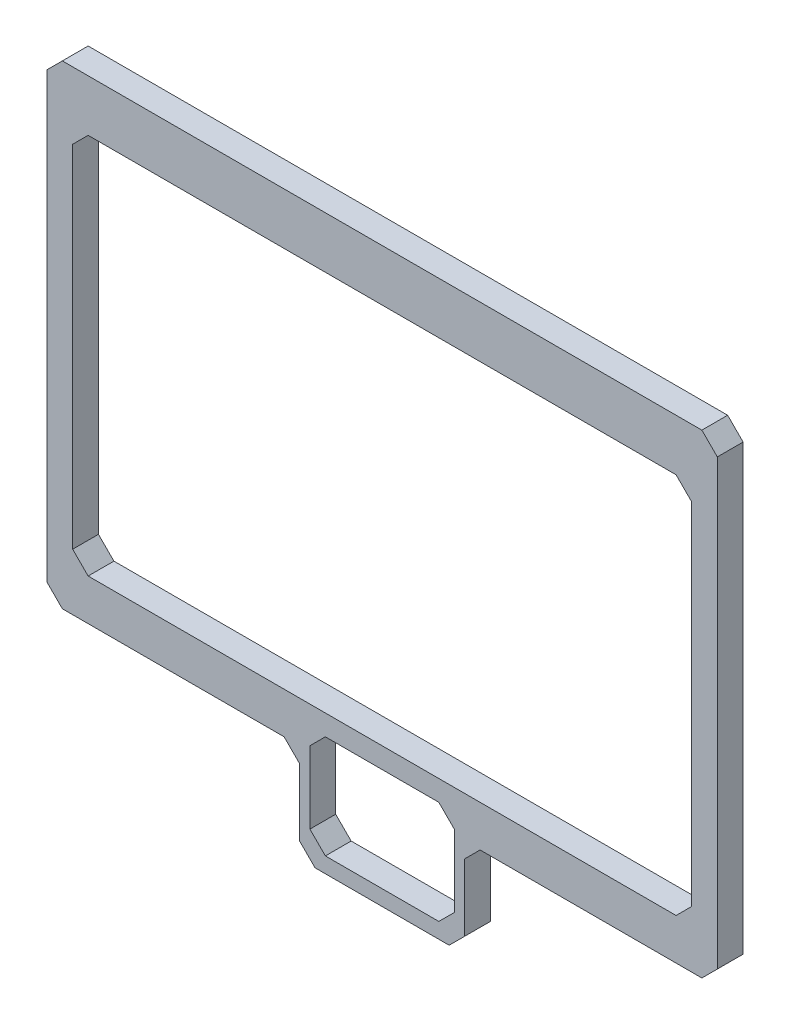
ISO-10303-21;
HEADER;
FILE_DESCRIPTION(('STEP AP214'),'2;1');
FILE_NAME('part.step','',(''),(''),'','','');
FILE_SCHEMA(('AUTOMOTIVE_DESIGN { 1 0 10303 214 1 1 1 1 }'));
ENDSEC;
DATA;
#1=APPLICATION_CONTEXT('core data for automotive mechanical design processes');
#2=APPLICATION_PROTOCOL_DEFINITION('international standard','automotive_design',2000,#1);
#3=PRODUCT_CONTEXT('',#1,'mechanical');
#4=PRODUCT('Part','Part','',(#3));
#5=PRODUCT_RELATED_PRODUCT_CATEGORY('part','',(#4));
#6=PRODUCT_DEFINITION_FORMATION('','',#4);
#7=PRODUCT_DEFINITION_CONTEXT('part definition',#1,'design');
#8=PRODUCT_DEFINITION('design','',#6,#7);
#9=PRODUCT_DEFINITION_SHAPE('','',#8);
#10=(LENGTH_UNIT() NAMED_UNIT(*) SI_UNIT(.MILLI.,.METRE.));
#11=(NAMED_UNIT(*) PLANE_ANGLE_UNIT() SI_UNIT($,.RADIAN.));
#12=(NAMED_UNIT(*) SI_UNIT($,.STERADIAN.) SOLID_ANGLE_UNIT());
#13=UNCERTAINTY_MEASURE_WITH_UNIT(LENGTH_MEASURE(1.E-05),#10,'distance_accuracy_value','');
#14=(GEOMETRIC_REPRESENTATION_CONTEXT(3) GLOBAL_UNCERTAINTY_ASSIGNED_CONTEXT((#13)) GLOBAL_UNIT_ASSIGNED_CONTEXT((#10,
#11,#12)) REPRESENTATION_CONTEXT('',''));
#15=CARTESIAN_POINT('',(0.,0.,0.));
#16=DIRECTION('',(0.,0.,1.));
#17=DIRECTION('',(1.,0.,0.));
#18=AXIS2_PLACEMENT_3D('',#15,#16,#17);
#19=CARTESIAN_POINT('',(0.,0.,5.));
#20=DIRECTION('',(0.,0.,1.));
#21=DIRECTION('',(1.,0.,0.));
#22=AXIS2_PLACEMENT_3D('',#19,#20,#21);
#23=PLANE('',#22);
#24=DIRECTION('',(0.707106781186547,0.707106781186547,0.));
#25=VECTOR('',#24,1.);
#26=CARTESIAN_POINT('',(78.,-101.,5.));
#27=LINE('',#26,#25);
#28=CARTESIAN_POINT('',(78.,-101.,5.));
#29=VERTEX_POINT('',#28);
#30=CARTESIAN_POINT('',(81.,-98.,5.));
#31=VERTEX_POINT('',#30);
#32=EDGE_CURVE('E366',#29,#31,#27,.T.);
#33=ORIENTED_EDGE('',*,*,#32,.T.);
#34=DIRECTION('',(0.,1.,0.));
#35=VECTOR('',#34,1.);
#36=CARTESIAN_POINT('',(81.,-98.,5.));
#37=LINE('',#36,#35);
#38=CARTESIAN_POINT('',(81.,-85.,5.));
#39=VERTEX_POINT('',#38);
#40=EDGE_CURVE('E369',#31,#39,#37,.T.);
#41=ORIENTED_EDGE('',*,*,#40,.T.);
#42=DIRECTION('',(0.707106781186551,0.707106781186544,0.));
#43=VECTOR('',#42,1.);
#44=CARTESIAN_POINT('',(81.,-85.,5.));
#45=LINE('',#44,#43);
#46=CARTESIAN_POINT('',(84.,-82.,5.));
#47=VERTEX_POINT('',#46);
#48=EDGE_CURVE('E372',#39,#47,#45,.T.);
#49=ORIENTED_EDGE('',*,*,#48,.T.);
#50=DIRECTION('',(1.,0.,0.));
#51=VECTOR('',#50,1.);
#52=CARTESIAN_POINT('',(127.,-82.,5.));
#53=LINE('',#52,#51);
#54=CARTESIAN_POINT('',(127.,-82.,5.));
#55=VERTEX_POINT('',#54);
#56=EDGE_CURVE('E374',#47,#55,#53,.T.);
#57=ORIENTED_EDGE('',*,*,#56,.T.);
#58=DIRECTION('',(0.707106781186548,0.707106781186548,0.));
#59=VECTOR('',#58,1.);
#60=CARTESIAN_POINT('',(127.,-82.,5.));
#61=LINE('',#60,#59);
#62=CARTESIAN_POINT('',(130.,-79.,5.));
#63=VERTEX_POINT('',#62);
#64=EDGE_CURVE('E376',#55,#63,#61,.T.);
#65=ORIENTED_EDGE('',*,*,#64,.T.);
#66=DIRECTION('',(0.,1.,0.));
#67=VECTOR('',#66,1.);
#68=CARTESIAN_POINT('',(130.,7.00000000000002,5.));
#69=LINE('',#68,#67);
#70=CARTESIAN_POINT('',(130.,7.00000000000002,5.));
#71=VERTEX_POINT('',#70);
#72=EDGE_CURVE('E378',#63,#71,#69,.T.);
#73=ORIENTED_EDGE('',*,*,#72,.T.);
#74=DIRECTION('',(-0.707106781186548,0.707106781186548,0.));
#75=VECTOR('',#74,1.);
#76=CARTESIAN_POINT('',(130.,7.00000000000002,5.));
#77=LINE('',#76,#75);
#78=CARTESIAN_POINT('',(127.,10.,5.));
#79=VERTEX_POINT('',#78);
#80=EDGE_CURVE('E380',#71,#79,#77,.T.);
#81=ORIENTED_EDGE('',*,*,#80,.T.);
#82=DIRECTION('',(-1.,0.,0.));
#83=VECTOR('',#82,1.);
#84=CARTESIAN_POINT('',(3.,10.,5.));
#85=LINE('',#84,#83);
#86=CARTESIAN_POINT('',(3.,10.,5.));
#87=VERTEX_POINT('',#86);
#88=EDGE_CURVE('E382',#79,#87,#85,.T.);
#89=ORIENTED_EDGE('',*,*,#88,.T.);
#90=DIRECTION('',(-0.707106781186544,-0.707106781186551,0.));
#91=VECTOR('',#90,1.);
#92=CARTESIAN_POINT('',(3.,10.,5.));
#93=LINE('',#92,#91);
#94=CARTESIAN_POINT('',(0.,6.99999999999997,5.));
#95=VERTEX_POINT('',#94);
#96=EDGE_CURVE('E384',#87,#95,#93,.T.);
#97=ORIENTED_EDGE('',*,*,#96,.T.);
#98=DIRECTION('',(0.,-1.,0.));
#99=VECTOR('',#98,1.);
#100=CARTESIAN_POINT('',(0.,6.99999999999997,5.));
#101=LINE('',#100,#99);
#102=CARTESIAN_POINT('',(0.,-79.,5.));
#103=VERTEX_POINT('',#102);
#104=EDGE_CURVE('E386',#95,#103,#101,.T.);
#105=ORIENTED_EDGE('',*,*,#104,.T.);
#106=DIRECTION('',(0.707106781186544,-0.707106781186551,0.));
#107=VECTOR('',#106,1.);
#108=CARTESIAN_POINT('',(0.,-79.,5.));
#109=LINE('',#108,#107);
#110=CARTESIAN_POINT('',(3.,-82.,5.));
#111=VERTEX_POINT('',#110);
#112=EDGE_CURVE('E388',#103,#111,#109,.T.);
#113=ORIENTED_EDGE('',*,*,#112,.T.);
#114=DIRECTION('',(1.,0.,0.));
#115=VECTOR('',#114,1.);
#116=CARTESIAN_POINT('',(46.,-82.,5.));
#117=LINE('',#116,#115);
#118=CARTESIAN_POINT('',(46.,-82.,5.));
#119=VERTEX_POINT('',#118);
#120=EDGE_CURVE('E390',#111,#119,#117,.T.);
#121=ORIENTED_EDGE('',*,*,#120,.T.);
#122=DIRECTION('',(0.707106781186541,-0.707106781186554,0.));
#123=VECTOR('',#122,1.);
#124=CARTESIAN_POINT('',(46.,-82.,5.));
#125=LINE('',#124,#123);
#126=CARTESIAN_POINT('',(49.,-85.,5.));
#127=VERTEX_POINT('',#126);
#128=EDGE_CURVE('E392',#119,#127,#125,.T.);
#129=ORIENTED_EDGE('',*,*,#128,.T.);
#130=DIRECTION('',(0.,-1.,0.));
#131=VECTOR('',#130,1.);
#132=CARTESIAN_POINT('',(49.,-85.,5.));
#133=LINE('',#132,#131);
#134=CARTESIAN_POINT('',(49.,-98.,5.));
#135=VERTEX_POINT('',#134);
#136=EDGE_CURVE('E394',#127,#135,#133,.T.);
#137=ORIENTED_EDGE('',*,*,#136,.T.);
#138=DIRECTION('',(0.707106781186547,-0.707106781186547,0.));
#139=VECTOR('',#138,1.);
#140=CARTESIAN_POINT('',(49.,-98.,5.));
#141=LINE('',#140,#139);
#142=CARTESIAN_POINT('',(52.,-101.,5.));
#143=VERTEX_POINT('',#142);
#144=EDGE_CURVE('E396',#135,#143,#141,.T.);
#145=ORIENTED_EDGE('',*,*,#144,.T.);
#146=DIRECTION('',(1.,0.,0.));
#147=VECTOR('',#146,1.);
#148=CARTESIAN_POINT('',(52.,-101.,5.));
#149=LINE('',#148,#147);
#150=EDGE_CURVE('E398',#143,#29,#149,.T.);
#151=ORIENTED_EDGE('',*,*,#150,.T.);
#152=EDGE_LOOP('',(#33,#41,#49,#57,#65,#73,#81,#89,#97,#105,#113,#121,#129,#137,#145,#151));
#153=FACE_BOUND('',#152,.T.);
#154=DIRECTION('',(-1.,0.,0.));
#155=VECTOR('',#154,1.);
#156=CARTESIAN_POINT('',(54.,-78.,5.));
#157=LINE('',#156,#155);
#158=CARTESIAN_POINT('',(76.,-78.,5.));
#159=VERTEX_POINT('',#158);
#160=CARTESIAN_POINT('',(54.,-78.,5.));
#161=VERTEX_POINT('',#160);
#162=EDGE_CURVE('E309',#159,#161,#157,.T.);
#163=ORIENTED_EDGE('',*,*,#162,.F.);
#164=DIRECTION('',(-0.707106781186544,0.707106781186551,0.));
#165=VECTOR('',#164,1.);
#166=CARTESIAN_POINT('',(76.,-78.,5.));
#167=LINE('',#166,#165);
#168=CARTESIAN_POINT('',(79.,-81.,5.));
#169=VERTEX_POINT('',#168);
#170=EDGE_CURVE('E307',#169,#159,#167,.T.);
#171=ORIENTED_EDGE('',*,*,#170,.F.);
#172=DIRECTION('',(0.,1.,0.));
#173=VECTOR('',#172,1.);
#174=CARTESIAN_POINT('',(79.,-81.,5.));
#175=LINE('',#174,#173);
#176=CARTESIAN_POINT('',(79.,-95.,5.));
#177=VERTEX_POINT('',#176);
#178=EDGE_CURVE('E323',#177,#169,#175,.T.);
#179=ORIENTED_EDGE('',*,*,#178,.F.);
#180=DIRECTION('',(0.707106781186551,0.707106781186544,0.));
#181=VECTOR('',#180,1.);
#182=CARTESIAN_POINT('',(79.,-95.,5.));
#183=LINE('',#182,#181);
#184=CARTESIAN_POINT('',(76.,-98.,5.));
#185=VERTEX_POINT('',#184);
#186=EDGE_CURVE('E320',#185,#177,#183,.T.);
#187=ORIENTED_EDGE('',*,*,#186,.F.);
#188=DIRECTION('',(1.,0.,0.));
#189=VECTOR('',#188,1.);
#190=CARTESIAN_POINT('',(76.,-98.,5.));
#191=LINE('',#190,#189);
#192=CARTESIAN_POINT('',(54.,-98.,5.));
#193=VERTEX_POINT('',#192);
#194=EDGE_CURVE('E318',#193,#185,#191,.T.);
#195=ORIENTED_EDGE('',*,*,#194,.F.);
#196=DIRECTION('',(0.707106781186544,-0.707106781186551,0.));
#197=VECTOR('',#196,1.);
#198=CARTESIAN_POINT('',(54.,-98.,5.));
#199=LINE('',#198,#197);
#200=CARTESIAN_POINT('',(51.,-95.,5.));
#201=VERTEX_POINT('',#200);
#202=EDGE_CURVE('E316',#201,#193,#199,.T.);
#203=ORIENTED_EDGE('',*,*,#202,.F.);
#204=DIRECTION('',(0.,-1.,0.));
#205=VECTOR('',#204,1.);
#206=CARTESIAN_POINT('',(51.,-95.,5.));
#207=LINE('',#206,#205);
#208=CARTESIAN_POINT('',(51.,-81.,5.));
#209=VERTEX_POINT('',#208);
#210=EDGE_CURVE('E314',#209,#201,#207,.T.);
#211=ORIENTED_EDGE('',*,*,#210,.F.);
#212=DIRECTION('',(-0.707106781186551,-0.707106781186544,0.));
#213=VECTOR('',#212,1.);
#214=CARTESIAN_POINT('',(51.,-81.,5.));
#215=LINE('',#214,#213);
#216=EDGE_CURVE('E312',#161,#209,#215,.T.);
#217=ORIENTED_EDGE('',*,*,#216,.F.);
#218=EDGE_LOOP('',(#163,#171,#179,#187,#195,#203,#211,#217));
#219=FACE_BOUND('',#218,.T.);
#220=DIRECTION('',(1.,0.,0.));
#221=VECTOR('',#220,1.);
#222=CARTESIAN_POINT('',(7.99999999999999,-74.,5.));
#223=LINE('',#222,#221);
#224=CARTESIAN_POINT('',(7.99999999999999,-74.,5.));
#225=VERTEX_POINT('',#224);
#226=CARTESIAN_POINT('',(122.,-74.,5.));
#227=VERTEX_POINT('',#226);
#228=EDGE_CURVE('E250',#225,#227,#223,.T.);
#229=ORIENTED_EDGE('',*,*,#228,.F.);
#230=DIRECTION('',(0.707106781186544,-0.707106781186551,0.));
#231=VECTOR('',#230,1.);
#232=CARTESIAN_POINT('',(7.99999999999999,-74.,5.));
#233=LINE('',#232,#231);
#234=CARTESIAN_POINT('',(4.99999999999999,-71.,5.));
#235=VERTEX_POINT('',#234);
#236=EDGE_CURVE('E242',#235,#225,#233,.T.);
#237=ORIENTED_EDGE('',*,*,#236,.F.);
#238=DIRECTION('',(0.,-1.,0.));
#239=VECTOR('',#238,1.);
#240=CARTESIAN_POINT('',(4.99999999999999,-71.,5.));
#241=LINE('',#240,#239);
#242=CARTESIAN_POINT('',(4.99999999999999,-3.00000000000003,5.));
#243=VERTEX_POINT('',#242);
#244=EDGE_CURVE('E275',#243,#235,#241,.T.);
#245=ORIENTED_EDGE('',*,*,#244,.F.);
#246=DIRECTION('',(-0.707106781186544,-0.707106781186551,0.));
#247=VECTOR('',#246,1.);
#248=CARTESIAN_POINT('',(4.99999999999999,-3.00000000000003,5.));
#249=LINE('',#248,#247);
#250=CARTESIAN_POINT('',(7.99999999999999,0.,5.));
#251=VERTEX_POINT('',#250);
#252=EDGE_CURVE('E273',#251,#243,#249,.T.);
#253=ORIENTED_EDGE('',*,*,#252,.F.);
#254=DIRECTION('',(-1.,0.,0.));
#255=VECTOR('',#254,1.);
#256=CARTESIAN_POINT('',(7.99999999999999,0.,5.));
#257=LINE('',#256,#255);
#258=CARTESIAN_POINT('',(122.,0.,5.));
#259=VERTEX_POINT('',#258);
#260=EDGE_CURVE('E271',#259,#251,#257,.T.);
#261=ORIENTED_EDGE('',*,*,#260,.F.);
#262=DIRECTION('',(-0.707106781186546,0.707106781186549,0.));
#263=VECTOR('',#262,1.);
#264=CARTESIAN_POINT('',(122.,0.,5.));
#265=LINE('',#264,#263);
#266=CARTESIAN_POINT('',(125.,-3.00000000000003,5.));
#267=VERTEX_POINT('',#266);
#268=EDGE_CURVE('E269',#267,#259,#265,.T.);
#269=ORIENTED_EDGE('',*,*,#268,.F.);
#270=DIRECTION('',(0.,1.,0.));
#271=VECTOR('',#270,1.);
#272=CARTESIAN_POINT('',(125.,-71.,5.));
#273=LINE('',#272,#271);
#274=CARTESIAN_POINT('',(125.,-71.,5.));
#275=VERTEX_POINT('',#274);
#276=EDGE_CURVE('E265',#275,#267,#273,.T.);
#277=ORIENTED_EDGE('',*,*,#276,.F.);
#278=DIRECTION('',(0.707106781186552,0.707106781186543,0.));
#279=VECTOR('',#278,1.);
#280=CARTESIAN_POINT('',(125.,-71.,5.));
#281=LINE('',#280,#279);
#282=EDGE_CURVE('E263',#227,#275,#281,.T.);
#283=ORIENTED_EDGE('',*,*,#282,.F.);
#284=EDGE_LOOP('',(#229,#237,#245,#253,#261,#269,#277,#283));
#285=FACE_BOUND('',#284,.T.);
#286=ADVANCED_FACE('F33',(#153,#219,#285),#23,.T.);
#287=CARTESIAN_POINT('',(0.,0.,0.));
#288=DIRECTION('',(0.,0.,1.));
#289=DIRECTION('',(1.,0.,0.));
#290=AXIS2_PLACEMENT_3D('',#287,#288,#289);
#291=PLANE('',#290);
#292=DIRECTION('',(-0.707106781186544,0.707106781186551,0.));
#293=VECTOR('',#292,1.);
#294=CARTESIAN_POINT('',(76.,-78.,0.));
#295=LINE('',#294,#293);
#296=CARTESIAN_POINT('',(79.,-81.,0.));
#297=VERTEX_POINT('',#296);
#298=CARTESIAN_POINT('',(76.,-78.,0.));
#299=VERTEX_POINT('',#298);
#300=EDGE_CURVE('E258',#297,#299,#295,.T.);
#301=ORIENTED_EDGE('',*,*,#300,.T.);
#302=DIRECTION('',(-1.,0.,0.));
#303=VECTOR('',#302,1.);
#304=CARTESIAN_POINT('',(54.,-78.,0.));
#305=LINE('',#304,#303);
#306=CARTESIAN_POINT('',(54.,-78.,0.));
#307=VERTEX_POINT('',#306);
#308=EDGE_CURVE('E328',#299,#307,#305,.T.);
#309=ORIENTED_EDGE('',*,*,#308,.T.);
#310=DIRECTION('',(-0.707106781186551,-0.707106781186544,0.));
#311=VECTOR('',#310,1.);
#312=CARTESIAN_POINT('',(51.,-81.,0.));
#313=LINE('',#312,#311);
#314=CARTESIAN_POINT('',(51.,-81.,0.));
#315=VERTEX_POINT('',#314);
#316=EDGE_CURVE('E331',#307,#315,#313,.T.);
#317=ORIENTED_EDGE('',*,*,#316,.T.);
#318=DIRECTION('',(0.,-1.,0.));
#319=VECTOR('',#318,1.);
#320=CARTESIAN_POINT('',(51.,-95.,0.));
#321=LINE('',#320,#319);
#322=CARTESIAN_POINT('',(51.,-95.,0.));
#323=VERTEX_POINT('',#322);
#324=EDGE_CURVE('E334',#315,#323,#321,.T.);
#325=ORIENTED_EDGE('',*,*,#324,.T.);
#326=DIRECTION('',(0.707106781186544,-0.707106781186551,0.));
#327=VECTOR('',#326,1.);
#328=CARTESIAN_POINT('',(54.,-98.,0.));
#329=LINE('',#328,#327);
#330=CARTESIAN_POINT('',(54.,-98.,0.));
#331=VERTEX_POINT('',#330);
#332=EDGE_CURVE('E337',#323,#331,#329,.T.);
#333=ORIENTED_EDGE('',*,*,#332,.T.);
#334=DIRECTION('',(1.,0.,0.));
#335=VECTOR('',#334,1.);
#336=CARTESIAN_POINT('',(76.,-98.,0.));
#337=LINE('',#336,#335);
#338=CARTESIAN_POINT('',(76.,-98.,0.));
#339=VERTEX_POINT('',#338);
#340=EDGE_CURVE('E340',#331,#339,#337,.T.);
#341=ORIENTED_EDGE('',*,*,#340,.T.);
#342=DIRECTION('',(0.707106781186551,0.707106781186544,0.));
#343=VECTOR('',#342,1.);
#344=CARTESIAN_POINT('',(79.,-95.,0.));
#345=LINE('',#344,#343);
#346=CARTESIAN_POINT('',(79.,-95.,0.));
#347=VERTEX_POINT('',#346);
#348=EDGE_CURVE('E343',#339,#347,#345,.T.);
#349=ORIENTED_EDGE('',*,*,#348,.T.);
#350=DIRECTION('',(0.,1.,0.));
#351=VECTOR('',#350,1.);
#352=CARTESIAN_POINT('',(79.,-81.,0.));
#353=LINE('',#352,#351);
#354=EDGE_CURVE('E310',#347,#297,#353,.T.);
#355=ORIENTED_EDGE('',*,*,#354,.T.);
#356=EDGE_LOOP('',(#301,#309,#317,#325,#333,#341,#349,#355));
#357=FACE_BOUND('',#356,.T.);
#358=DIRECTION('',(0.707106781186547,0.707106781186547,0.));
#359=VECTOR('',#358,1.);
#360=CARTESIAN_POINT('',(78.,-101.,0.));
#361=LINE('',#360,#359);
#362=CARTESIAN_POINT('',(78.,-101.,0.));
#363=VERTEX_POINT('',#362);
#364=CARTESIAN_POINT('',(81.,-98.,0.));
#365=VERTEX_POINT('',#364);
#366=EDGE_CURVE('E365',#363,#365,#361,.T.);
#367=ORIENTED_EDGE('',*,*,#366,.F.);
#368=DIRECTION('',(1.,0.,0.));
#369=VECTOR('',#368,1.);
#370=CARTESIAN_POINT('',(52.,-101.,0.));
#371=LINE('',#370,#369);
#372=CARTESIAN_POINT('',(52.,-101.,0.));
#373=VERTEX_POINT('',#372);
#374=EDGE_CURVE('E370',#373,#363,#371,.T.);
#375=ORIENTED_EDGE('',*,*,#374,.F.);
#376=DIRECTION('',(0.707106781186547,-0.707106781186547,0.));
#377=VECTOR('',#376,1.);
#378=CARTESIAN_POINT('',(49.,-98.,0.));
#379=LINE('',#378,#377);
#380=CARTESIAN_POINT('',(49.,-98.,0.));
#381=VERTEX_POINT('',#380);
#382=EDGE_CURVE('E429',#381,#373,#379,.T.);
#383=ORIENTED_EDGE('',*,*,#382,.F.);
#384=DIRECTION('',(0.,-1.,0.));
#385=VECTOR('',#384,1.);
#386=CARTESIAN_POINT('',(49.,-85.,0.));
#387=LINE('',#386,#385);
#388=CARTESIAN_POINT('',(49.,-85.,0.));
#389=VERTEX_POINT('',#388);
#390=EDGE_CURVE('E427',#389,#381,#387,.T.);
#391=ORIENTED_EDGE('',*,*,#390,.F.);
#392=DIRECTION('',(0.707106781186541,-0.707106781186554,0.));
#393=VECTOR('',#392,1.);
#394=CARTESIAN_POINT('',(46.,-82.,0.));
#395=LINE('',#394,#393);
#396=CARTESIAN_POINT('',(46.,-82.,0.));
#397=VERTEX_POINT('',#396);
#398=EDGE_CURVE('E425',#397,#389,#395,.T.);
#399=ORIENTED_EDGE('',*,*,#398,.F.);
#400=DIRECTION('',(1.,0.,0.));
#401=VECTOR('',#400,1.);
#402=CARTESIAN_POINT('',(46.,-82.,0.));
#403=LINE('',#402,#401);
#404=CARTESIAN_POINT('',(3.,-82.,0.));
#405=VERTEX_POINT('',#404);
#406=EDGE_CURVE('E423',#405,#397,#403,.T.);
#407=ORIENTED_EDGE('',*,*,#406,.F.);
#408=DIRECTION('',(0.707106781186544,-0.707106781186551,0.));
#409=VECTOR('',#408,1.);
#410=CARTESIAN_POINT('',(0.,-79.,0.));
#411=LINE('',#410,#409);
#412=CARTESIAN_POINT('',(0.,-79.,0.));
#413=VERTEX_POINT('',#412);
#414=EDGE_CURVE('E421',#413,#405,#411,.T.);
#415=ORIENTED_EDGE('',*,*,#414,.F.);
#416=DIRECTION('',(0.,-1.,0.));
#417=VECTOR('',#416,1.);
#418=CARTESIAN_POINT('',(0.,6.99999999999997,0.));
#419=LINE('',#418,#417);
#420=CARTESIAN_POINT('',(0.,6.99999999999997,0.));
#421=VERTEX_POINT('',#420);
#422=EDGE_CURVE('E419',#421,#413,#419,.T.);
#423=ORIENTED_EDGE('',*,*,#422,.F.);
#424=DIRECTION('',(-0.707106781186544,-0.707106781186551,0.));
#425=VECTOR('',#424,1.);
#426=CARTESIAN_POINT('',(3.,10.,0.));
#427=LINE('',#426,#425);
#428=CARTESIAN_POINT('',(3.,10.,0.));
#429=VERTEX_POINT('',#428);
#430=EDGE_CURVE('E417',#429,#421,#427,.T.);
#431=ORIENTED_EDGE('',*,*,#430,.F.);
#432=DIRECTION('',(-1.,0.,0.));
#433=VECTOR('',#432,1.);
#434=CARTESIAN_POINT('',(3.,10.,0.));
#435=LINE('',#434,#433);
#436=CARTESIAN_POINT('',(127.,10.,0.));
#437=VERTEX_POINT('',#436);
#438=EDGE_CURVE('E415',#437,#429,#435,.T.);
#439=ORIENTED_EDGE('',*,*,#438,.F.);
#440=DIRECTION('',(-0.707106781186548,0.707106781186548,0.));
#441=VECTOR('',#440,1.);
#442=CARTESIAN_POINT('',(130.,7.00000000000002,0.));
#443=LINE('',#442,#441);
#444=CARTESIAN_POINT('',(130.,7.00000000000002,0.));
#445=VERTEX_POINT('',#444);
#446=EDGE_CURVE('E413',#445,#437,#443,.T.);
#447=ORIENTED_EDGE('',*,*,#446,.F.);
#448=DIRECTION('',(0.,1.,0.));
#449=VECTOR('',#448,1.);
#450=CARTESIAN_POINT('',(130.,7.00000000000002,0.));
#451=LINE('',#450,#449);
#452=CARTESIAN_POINT('',(130.,-79.,0.));
#453=VERTEX_POINT('',#452);
#454=EDGE_CURVE('E411',#453,#445,#451,.T.);
#455=ORIENTED_EDGE('',*,*,#454,.F.);
#456=DIRECTION('',(0.707106781186548,0.707106781186548,0.));
#457=VECTOR('',#456,1.);
#458=CARTESIAN_POINT('',(127.,-82.,0.));
#459=LINE('',#458,#457);
#460=CARTESIAN_POINT('',(127.,-82.,0.));
#461=VERTEX_POINT('',#460);
#462=EDGE_CURVE('E409',#461,#453,#459,.T.);
#463=ORIENTED_EDGE('',*,*,#462,.F.);
#464=DIRECTION('',(1.,0.,0.));
#465=VECTOR('',#464,1.);
#466=CARTESIAN_POINT('',(127.,-82.,0.));
#467=LINE('',#466,#465);
#468=CARTESIAN_POINT('',(84.,-82.,0.));
#469=VERTEX_POINT('',#468);
#470=EDGE_CURVE('E407',#469,#461,#467,.T.);
#471=ORIENTED_EDGE('',*,*,#470,.F.);
#472=DIRECTION('',(0.707106781186551,0.707106781186544,0.));
#473=VECTOR('',#472,1.);
#474=CARTESIAN_POINT('',(81.,-85.,0.));
#475=LINE('',#474,#473);
#476=CARTESIAN_POINT('',(81.,-85.,0.));
#477=VERTEX_POINT('',#476);
#478=EDGE_CURVE('E405',#477,#469,#475,.T.);
#479=ORIENTED_EDGE('',*,*,#478,.F.);
#480=DIRECTION('',(0.,1.,0.));
#481=VECTOR('',#480,1.);
#482=CARTESIAN_POINT('',(81.,-98.,0.));
#483=LINE('',#482,#481);
#484=EDGE_CURVE('E403',#365,#477,#483,.T.);
#485=ORIENTED_EDGE('',*,*,#484,.F.);
#486=EDGE_LOOP('',(#367,#375,#383,#391,#399,#407,#415,#423,#431,#439,#447,#455,#463,#471,#479,#485));
#487=FACE_BOUND('',#486,.T.);
#488=DIRECTION('',(0.707106781186544,-0.707106781186551,0.));
#489=VECTOR('',#488,1.);
#490=CARTESIAN_POINT('',(7.99999999999999,-74.,0.));
#491=LINE('',#490,#489);
#492=CARTESIAN_POINT('',(4.99999999999999,-71.,0.));
#493=VERTEX_POINT('',#492);
#494=CARTESIAN_POINT('',(7.99999999999999,-74.,0.));
#495=VERTEX_POINT('',#494);
#496=EDGE_CURVE('E56',#493,#495,#491,.T.);
#497=ORIENTED_EDGE('',*,*,#496,.T.);
#498=DIRECTION('',(1.,0.,0.));
#499=VECTOR('',#498,1.);
#500=CARTESIAN_POINT('',(7.99999999999999,-74.,0.));
#501=LINE('',#500,#499);
#502=CARTESIAN_POINT('',(122.,-74.,0.));
#503=VERTEX_POINT('',#502);
#504=EDGE_CURVE('E257',#495,#503,#501,.T.);
#505=ORIENTED_EDGE('',*,*,#504,.T.);
#506=DIRECTION('',(0.707106781186552,0.707106781186543,0.));
#507=VECTOR('',#506,1.);
#508=CARTESIAN_POINT('',(125.,-71.,0.));
#509=LINE('',#508,#507);
#510=CARTESIAN_POINT('',(125.,-71.,0.));
#511=VERTEX_POINT('',#510);
#512=EDGE_CURVE('E279',#503,#511,#509,.T.);
#513=ORIENTED_EDGE('',*,*,#512,.T.);
#514=DIRECTION('',(0.,1.,0.));
#515=VECTOR('',#514,1.);
#516=CARTESIAN_POINT('',(125.,-71.,0.));
#517=LINE('',#516,#515);
#518=CARTESIAN_POINT('',(125.,-3.00000000000003,0.));
#519=VERTEX_POINT('',#518);
#520=EDGE_CURVE('E282',#511,#519,#517,.T.);
#521=ORIENTED_EDGE('',*,*,#520,.T.);
#522=DIRECTION('',(-0.707106781186546,0.707106781186549,0.));
#523=VECTOR('',#522,1.);
#524=CARTESIAN_POINT('',(122.,0.,0.));
#525=LINE('',#524,#523);
#526=CARTESIAN_POINT('',(122.,0.,0.));
#527=VERTEX_POINT('',#526);
#528=EDGE_CURVE('E285',#519,#527,#525,.T.);
#529=ORIENTED_EDGE('',*,*,#528,.T.);
#530=DIRECTION('',(-1.,0.,0.));
#531=VECTOR('',#530,1.);
#532=CARTESIAN_POINT('',(7.99999999999999,0.,0.));
#533=LINE('',#532,#531);
#534=CARTESIAN_POINT('',(7.99999999999999,0.,0.));
#535=VERTEX_POINT('',#534);
#536=EDGE_CURVE('E288',#527,#535,#533,.T.);
#537=ORIENTED_EDGE('',*,*,#536,.T.);
#538=DIRECTION('',(-0.707106781186544,-0.707106781186551,0.));
#539=VECTOR('',#538,1.);
#540=CARTESIAN_POINT('',(4.99999999999999,-3.00000000000003,0.));
#541=LINE('',#540,#539);
#542=CARTESIAN_POINT('',(4.99999999999999,-3.00000000000003,0.));
#543=VERTEX_POINT('',#542);
#544=EDGE_CURVE('E291',#535,#543,#541,.T.);
#545=ORIENTED_EDGE('',*,*,#544,.T.);
#546=DIRECTION('',(0.,-1.,0.));
#547=VECTOR('',#546,1.);
#548=CARTESIAN_POINT('',(4.99999999999999,-71.,0.));
#549=LINE('',#548,#547);
#550=EDGE_CURVE('E251',#543,#493,#549,.T.);
#551=ORIENTED_EDGE('',*,*,#550,.T.);
#552=EDGE_LOOP('',(#497,#505,#513,#521,#529,#537,#545,#551));
#553=FACE_BOUND('',#552,.T.);
#554=ADVANCED_FACE('F483',(#357,#487,#553),#291,.F.);
#555=CARTESIAN_POINT('',(78.,-101.,5.));
#556=DIRECTION('',(-0.707106781186548,0.707106781186548,0.));
#557=DIRECTION('',(-0.707106781186548,-0.707106781186548,0.));
#558=AXIS2_PLACEMENT_3D('',#555,#556,#557);
#559=PLANE('',#558);
#560=ORIENTED_EDGE('',*,*,#366,.T.);
#561=DIRECTION('',(0.,0.,-1.));
#562=VECTOR('',#561,1.);
#563=CARTESIAN_POINT('',(81.,-98.,5.));
#564=LINE('',#563,#562);
#565=EDGE_CURVE('E11',#31,#365,#564,.T.);
#566=ORIENTED_EDGE('',*,*,#565,.F.);
#567=ORIENTED_EDGE('',*,*,#32,.F.);
#568=DIRECTION('',(0.,0.,-1.));
#569=VECTOR('',#568,1.);
#570=CARTESIAN_POINT('',(78.,-101.,5.));
#571=LINE('',#570,#569);
#572=EDGE_CURVE('E400',#29,#363,#571,.T.);
#573=ORIENTED_EDGE('',*,*,#572,.T.);
#574=EDGE_LOOP('',(#560,#566,#567,#573));
#575=FACE_BOUND('',#574,.T.);
#576=ADVANCED_FACE('F35',(#575),#559,.F.);
#577=CARTESIAN_POINT('',(81.,-98.,5.));
#578=DIRECTION('',(-1.,0.,0.));
#579=DIRECTION('',(0.,0.,1.));
#580=AXIS2_PLACEMENT_3D('',#577,#578,#579);
#581=PLANE('',#580);
#582=ORIENTED_EDGE('',*,*,#484,.T.);
#583=DIRECTION('',(0.,0.,-1.));
#584=VECTOR('',#583,1.);
#585=CARTESIAN_POINT('',(81.,-85.,5.));
#586=LINE('',#585,#584);
#587=EDGE_CURVE('E41',#39,#477,#586,.T.);
#588=ORIENTED_EDGE('',*,*,#587,.F.);
#589=ORIENTED_EDGE('',*,*,#40,.F.);
#590=ORIENTED_EDGE('',*,*,#565,.T.);
#591=EDGE_LOOP('',(#582,#588,#589,#590));
#592=FACE_BOUND('',#591,.T.);
#593=ADVANCED_FACE('F501',(#592),#581,.F.);
#594=CARTESIAN_POINT('',(81.,-85.,5.));
#595=DIRECTION('',(-0.707106781186544,0.707106781186551,0.));
#596=DIRECTION('',(-0.707106781186551,-0.707106781186544,0.));
#597=AXIS2_PLACEMENT_3D('',#594,#595,#596);
#598=PLANE('',#597);
#599=ORIENTED_EDGE('',*,*,#478,.T.);
#600=DIRECTION('',(0.,0.,-1.));
#601=VECTOR('',#600,1.);
#602=CARTESIAN_POINT('',(84.,-82.,5.));
#603=LINE('',#602,#601);
#604=EDGE_CURVE('E470',#47,#469,#603,.T.);
#605=ORIENTED_EDGE('',*,*,#604,.F.);
#606=ORIENTED_EDGE('',*,*,#48,.F.);
#607=ORIENTED_EDGE('',*,*,#587,.T.);
#608=EDGE_LOOP('',(#599,#605,#606,#607));
#609=FACE_BOUND('',#608,.T.);
#610=ADVANCED_FACE('F477',(#609),#598,.F.);
#611=CARTESIAN_POINT('',(127.,-82.,5.));
#612=DIRECTION('',(0.,1.,0.));
#613=DIRECTION('',(0.,0.,1.));
#614=AXIS2_PLACEMENT_3D('',#611,#612,#613);
#615=PLANE('',#614);
#616=ORIENTED_EDGE('',*,*,#470,.T.);
#617=DIRECTION('',(0.,0.,-1.));
#618=VECTOR('',#617,1.);
#619=CARTESIAN_POINT('',(127.,-82.,5.));
#620=LINE('',#619,#618);
#621=EDGE_CURVE('E467',#55,#461,#620,.T.);
#622=ORIENTED_EDGE('',*,*,#621,.F.);
#623=ORIENTED_EDGE('',*,*,#56,.F.);
#624=ORIENTED_EDGE('',*,*,#604,.T.);
#625=EDGE_LOOP('',(#616,#622,#623,#624));
#626=FACE_BOUND('',#625,.T.);
#627=ADVANCED_FACE('F489',(#626),#615,.F.);
#628=CARTESIAN_POINT('',(127.,-82.,5.));
#629=DIRECTION('',(-0.707106781186548,0.707106781186548,0.));
#630=DIRECTION('',(-0.707106781186548,-0.707106781186548,0.));
#631=AXIS2_PLACEMENT_3D('',#628,#629,#630);
#632=PLANE('',#631);
#633=ORIENTED_EDGE('',*,*,#462,.T.);
#634=DIRECTION('',(0.,0.,-1.));
#635=VECTOR('',#634,1.);
#636=CARTESIAN_POINT('',(130.,-79.,5.));
#637=LINE('',#636,#635);
#638=EDGE_CURVE('E464',#63,#453,#637,.T.);
#639=ORIENTED_EDGE('',*,*,#638,.F.);
#640=ORIENTED_EDGE('',*,*,#64,.F.);
#641=ORIENTED_EDGE('',*,*,#621,.T.);
#642=EDGE_LOOP('',(#633,#639,#640,#641));
#643=FACE_BOUND('',#642,.T.);
#644=ADVANCED_FACE('F493',(#643),#632,.F.);
#645=CARTESIAN_POINT('',(130.,7.00000000000002,5.));
#646=DIRECTION('',(-1.,0.,0.));
#647=DIRECTION('',(0.,0.,1.));
#648=AXIS2_PLACEMENT_3D('',#645,#646,#647);
#649=PLANE('',#648);
#650=ORIENTED_EDGE('',*,*,#454,.T.);
#651=DIRECTION('',(0.,0.,-1.));
#652=VECTOR('',#651,1.);
#653=CARTESIAN_POINT('',(130.,7.00000000000002,5.));
#654=LINE('',#653,#652);
#655=EDGE_CURVE('E461',#71,#445,#654,.T.);
#656=ORIENTED_EDGE('',*,*,#655,.F.);
#657=ORIENTED_EDGE('',*,*,#72,.F.);
#658=ORIENTED_EDGE('',*,*,#638,.T.);
#659=EDGE_LOOP('',(#650,#656,#657,#658));
#660=FACE_BOUND('',#659,.T.);
#661=ADVANCED_FACE('F554',(#660),#649,.F.);
#662=CARTESIAN_POINT('',(130.,7.00000000000002,5.));
#663=DIRECTION('',(-0.707106781186548,-0.707106781186548,0.));
#664=DIRECTION('',(0.707106781186548,-0.707106781186548,0.));
#665=AXIS2_PLACEMENT_3D('',#662,#663,#664);
#666=PLANE('',#665);
#667=ORIENTED_EDGE('',*,*,#446,.T.);
#668=DIRECTION('',(0.,0.,-1.));
#669=VECTOR('',#668,1.);
#670=CARTESIAN_POINT('',(127.,10.,5.));
#671=LINE('',#670,#669);
#672=EDGE_CURVE('E458',#79,#437,#671,.T.);
#673=ORIENTED_EDGE('',*,*,#672,.F.);
#674=ORIENTED_EDGE('',*,*,#80,.F.);
#675=ORIENTED_EDGE('',*,*,#655,.T.);
#676=EDGE_LOOP('',(#667,#673,#674,#675));
#677=FACE_BOUND('',#676,.T.);
#678=ADVANCED_FACE('F551',(#677),#666,.F.);
#679=CARTESIAN_POINT('',(3.,10.,5.));
#680=DIRECTION('',(0.,-1.,0.));
#681=DIRECTION('',(0.,0.,-1.));
#682=AXIS2_PLACEMENT_3D('',#679,#680,#681);
#683=PLANE('',#682);
#684=ORIENTED_EDGE('',*,*,#438,.T.);
#685=DIRECTION('',(0.,0.,-1.));
#686=VECTOR('',#685,1.);
#687=CARTESIAN_POINT('',(3.,10.,5.));
#688=LINE('',#687,#686);
#689=EDGE_CURVE('E455',#87,#429,#688,.T.);
#690=ORIENTED_EDGE('',*,*,#689,.F.);
#691=ORIENTED_EDGE('',*,*,#88,.F.);
#692=ORIENTED_EDGE('',*,*,#672,.T.);
#693=EDGE_LOOP('',(#684,#690,#691,#692));
#694=FACE_BOUND('',#693,.T.);
#695=ADVANCED_FACE('F547',(#694),#683,.F.);
#696=CARTESIAN_POINT('',(3.,10.,5.));
#697=DIRECTION('',(0.707106781186551,-0.707106781186544,0.));
#698=DIRECTION('',(0.707106781186544,0.707106781186551,0.));
#699=AXIS2_PLACEMENT_3D('',#696,#697,#698);
#700=PLANE('',#699);
#701=ORIENTED_EDGE('',*,*,#430,.T.);
#702=DIRECTION('',(0.,0.,-1.));
#703=VECTOR('',#702,1.);
#704=CARTESIAN_POINT('',(0.,6.99999999999997,5.));
#705=LINE('',#704,#703);
#706=EDGE_CURVE('E452',#95,#421,#705,.T.);
#707=ORIENTED_EDGE('',*,*,#706,.F.);
#708=ORIENTED_EDGE('',*,*,#96,.F.);
#709=ORIENTED_EDGE('',*,*,#689,.T.);
#710=EDGE_LOOP('',(#701,#707,#708,#709));
#711=FACE_BOUND('',#710,.T.);
#712=ADVANCED_FACE('F543',(#711),#700,.F.);
#713=CARTESIAN_POINT('',(0.,6.99999999999997,5.));
#714=DIRECTION('',(1.,0.,0.));
#715=DIRECTION('',(0.,0.,-1.));
#716=AXIS2_PLACEMENT_3D('',#713,#714,#715);
#717=PLANE('',#716);
#718=ORIENTED_EDGE('',*,*,#422,.T.);
#719=DIRECTION('',(0.,0.,-1.));
#720=VECTOR('',#719,1.);
#721=CARTESIAN_POINT('',(0.,-79.,5.));
#722=LINE('',#721,#720);
#723=EDGE_CURVE('E449',#103,#413,#722,.T.);
#724=ORIENTED_EDGE('',*,*,#723,.F.);
#725=ORIENTED_EDGE('',*,*,#104,.F.);
#726=ORIENTED_EDGE('',*,*,#706,.T.);
#727=EDGE_LOOP('',(#718,#724,#725,#726));
#728=FACE_BOUND('',#727,.T.);
#729=ADVANCED_FACE('F538',(#728),#717,.F.);
#730=CARTESIAN_POINT('',(0.,-79.,5.));
#731=DIRECTION('',(0.707106781186551,0.707106781186544,0.));
#732=DIRECTION('',(-0.707106781186544,0.707106781186551,0.));
#733=AXIS2_PLACEMENT_3D('',#730,#731,#732);
#734=PLANE('',#733);
#735=ORIENTED_EDGE('',*,*,#414,.T.);
#736=DIRECTION('',(0.,0.,-1.));
#737=VECTOR('',#736,1.);
#738=CARTESIAN_POINT('',(3.,-82.,5.));
#739=LINE('',#738,#737);
#740=EDGE_CURVE('E446',#111,#405,#739,.T.);
#741=ORIENTED_EDGE('',*,*,#740,.F.);
#742=ORIENTED_EDGE('',*,*,#112,.F.);
#743=ORIENTED_EDGE('',*,*,#723,.T.);
#744=EDGE_LOOP('',(#735,#741,#742,#743));
#745=FACE_BOUND('',#744,.T.);
#746=ADVANCED_FACE('F532',(#745),#734,.F.);
#747=CARTESIAN_POINT('',(46.,-82.,5.));
#748=DIRECTION('',(0.,1.,0.));
#749=DIRECTION('',(0.,0.,1.));
#750=AXIS2_PLACEMENT_3D('',#747,#748,#749);
#751=PLANE('',#750);
#752=ORIENTED_EDGE('',*,*,#406,.T.);
#753=DIRECTION('',(0.,0.,-1.));
#754=VECTOR('',#753,1.);
#755=CARTESIAN_POINT('',(46.,-82.,5.));
#756=LINE('',#755,#754);
#757=EDGE_CURVE('E443',#119,#397,#756,.T.);
#758=ORIENTED_EDGE('',*,*,#757,.F.);
#759=ORIENTED_EDGE('',*,*,#120,.F.);
#760=ORIENTED_EDGE('',*,*,#740,.T.);
#761=EDGE_LOOP('',(#752,#758,#759,#760));
#762=FACE_BOUND('',#761,.T.);
#763=ADVANCED_FACE('F528',(#762),#751,.F.);
#764=CARTESIAN_POINT('',(46.,-82.,5.));
#765=DIRECTION('',(0.707106781186554,0.707106781186541,0.));
#766=DIRECTION('',(-0.707106781186541,0.707106781186554,0.));
#767=AXIS2_PLACEMENT_3D('',#764,#765,#766);
#768=PLANE('',#767);
#769=ORIENTED_EDGE('',*,*,#398,.T.);
#770=DIRECTION('',(0.,0.,-1.));
#771=VECTOR('',#770,1.);
#772=CARTESIAN_POINT('',(49.,-85.,5.));
#773=LINE('',#772,#771);
#774=EDGE_CURVE('E440',#127,#389,#773,.T.);
#775=ORIENTED_EDGE('',*,*,#774,.F.);
#776=ORIENTED_EDGE('',*,*,#128,.F.);
#777=ORIENTED_EDGE('',*,*,#757,.T.);
#778=EDGE_LOOP('',(#769,#775,#776,#777));
#779=FACE_BOUND('',#778,.T.);
#780=ADVANCED_FACE('F523',(#779),#768,.F.);
#781=CARTESIAN_POINT('',(49.,-85.,5.));
#782=DIRECTION('',(1.,0.,0.));
#783=DIRECTION('',(0.,1.,0.));
#784=AXIS2_PLACEMENT_3D('',#781,#782,#783);
#785=PLANE('',#784);
#786=ORIENTED_EDGE('',*,*,#390,.T.);
#787=DIRECTION('',(0.,0.,-1.));
#788=VECTOR('',#787,1.);
#789=CARTESIAN_POINT('',(49.,-98.,5.));
#790=LINE('',#789,#788);
#791=EDGE_CURVE('E437',#135,#381,#790,.T.);
#792=ORIENTED_EDGE('',*,*,#791,.F.);
#793=ORIENTED_EDGE('',*,*,#136,.F.);
#794=ORIENTED_EDGE('',*,*,#774,.T.);
#795=EDGE_LOOP('',(#786,#792,#793,#794));
#796=FACE_BOUND('',#795,.T.);
#797=ADVANCED_FACE('F517',(#796),#785,.F.);
#798=CARTESIAN_POINT('',(49.,-98.,5.));
#799=DIRECTION('',(0.707106781186548,0.707106781186548,0.));
#800=DIRECTION('',(-0.707106781186548,0.707106781186548,0.));
#801=AXIS2_PLACEMENT_3D('',#798,#799,#800);
#802=PLANE('',#801);
#803=ORIENTED_EDGE('',*,*,#382,.T.);
#804=DIRECTION('',(0.,0.,-1.));
#805=VECTOR('',#804,1.);
#806=CARTESIAN_POINT('',(52.,-101.,5.));
#807=LINE('',#806,#805);
#808=EDGE_CURVE('E434',#143,#373,#807,.T.);
#809=ORIENTED_EDGE('',*,*,#808,.F.);
#810=ORIENTED_EDGE('',*,*,#144,.F.);
#811=ORIENTED_EDGE('',*,*,#791,.T.);
#812=EDGE_LOOP('',(#803,#809,#810,#811));
#813=FACE_BOUND('',#812,.T.);
#814=ADVANCED_FACE('F513',(#813),#802,.F.);
#815=CARTESIAN_POINT('',(52.,-101.,5.));
#816=DIRECTION('',(0.,1.,0.));
#817=DIRECTION('',(0.,0.,1.));
#818=AXIS2_PLACEMENT_3D('',#815,#816,#817);
#819=PLANE('',#818);
#820=ORIENTED_EDGE('',*,*,#374,.T.);
#821=ORIENTED_EDGE('',*,*,#572,.F.);
#822=ORIENTED_EDGE('',*,*,#150,.F.);
#823=ORIENTED_EDGE('',*,*,#808,.T.);
#824=EDGE_LOOP('',(#820,#821,#822,#823));
#825=FACE_BOUND('',#824,.T.);
#826=ADVANCED_FACE('F508',(#825),#819,.F.);
#827=CARTESIAN_POINT('',(76.,-78.,5.));
#828=DIRECTION('',(-0.707106781186551,-0.707106781186544,0.));
#829=DIRECTION('',(0.707106781186544,-0.707106781186551,0.));
#830=AXIS2_PLACEMENT_3D('',#827,#828,#829);
#831=PLANE('',#830);
#832=ORIENTED_EDGE('',*,*,#300,.F.);
#833=DIRECTION('',(0.,0.,-1.));
#834=VECTOR('',#833,1.);
#835=CARTESIAN_POINT('',(79.,-81.,5.));
#836=LINE('',#835,#834);
#837=EDGE_CURVE('E325',#169,#297,#836,.T.);
#838=ORIENTED_EDGE('',*,*,#837,.F.);
#839=ORIENTED_EDGE('',*,*,#170,.T.);
#840=DIRECTION('',(0.,0.,-1.));
#841=VECTOR('',#840,1.);
#842=CARTESIAN_POINT('',(76.,-78.,5.));
#843=LINE('',#842,#841);
#844=EDGE_CURVE('E362',#159,#299,#843,.T.);
#845=ORIENTED_EDGE('',*,*,#844,.T.);
#846=EDGE_LOOP('',(#832,#838,#839,#845));
#847=FACE_BOUND('',#846,.T.);
#848=ADVANCED_FACE('F571',(#847),#831,.T.);
#849=CARTESIAN_POINT('',(54.,-78.,5.));
#850=DIRECTION('',(0.,-1.,0.));
#851=DIRECTION('',(0.,0.,-1.));
#852=AXIS2_PLACEMENT_3D('',#849,#850,#851);
#853=PLANE('',#852);
#854=ORIENTED_EDGE('',*,*,#308,.F.);
#855=ORIENTED_EDGE('',*,*,#844,.F.);
#856=ORIENTED_EDGE('',*,*,#162,.T.);
#857=DIRECTION('',(0.,0.,-1.));
#858=VECTOR('',#857,1.);
#859=CARTESIAN_POINT('',(54.,-78.,5.));
#860=LINE('',#859,#858);
#861=EDGE_CURVE('E360',#161,#307,#860,.T.);
#862=ORIENTED_EDGE('',*,*,#861,.T.);
#863=EDGE_LOOP('',(#854,#855,#856,#862));
#864=FACE_BOUND('',#863,.T.);
#865=ADVANCED_FACE('F633',(#864),#853,.T.);
#866=CARTESIAN_POINT('',(51.,-81.,5.));
#867=DIRECTION('',(0.707106781186544,-0.707106781186551,0.));
#868=DIRECTION('',(0.707106781186551,0.707106781186544,0.));
#869=AXIS2_PLACEMENT_3D('',#866,#867,#868);
#870=PLANE('',#869);
#871=ORIENTED_EDGE('',*,*,#316,.F.);
#872=ORIENTED_EDGE('',*,*,#861,.F.);
#873=ORIENTED_EDGE('',*,*,#216,.T.);
#874=DIRECTION('',(0.,0.,-1.));
#875=VECTOR('',#874,1.);
#876=CARTESIAN_POINT('',(51.,-81.,5.));
#877=LINE('',#876,#875);
#878=EDGE_CURVE('E358',#209,#315,#877,.T.);
#879=ORIENTED_EDGE('',*,*,#878,.T.);
#880=EDGE_LOOP('',(#871,#872,#873,#879));
#881=FACE_BOUND('',#880,.T.);
#882=ADVANCED_FACE('F640',(#881),#870,.T.);
#883=CARTESIAN_POINT('',(51.,-95.,5.));
#884=DIRECTION('',(1.,0.,0.));
#885=DIRECTION('',(0.,0.,-1.));
#886=AXIS2_PLACEMENT_3D('',#883,#884,#885);
#887=PLANE('',#886);
#888=ORIENTED_EDGE('',*,*,#324,.F.);
#889=ORIENTED_EDGE('',*,*,#878,.F.);
#890=ORIENTED_EDGE('',*,*,#210,.T.);
#891=DIRECTION('',(0.,0.,-1.));
#892=VECTOR('',#891,1.);
#893=CARTESIAN_POINT('',(51.,-95.,5.));
#894=LINE('',#893,#892);
#895=EDGE_CURVE('E356',#201,#323,#894,.T.);
#896=ORIENTED_EDGE('',*,*,#895,.T.);
#897=EDGE_LOOP('',(#888,#889,#890,#896));
#898=FACE_BOUND('',#897,.T.);
#899=ADVANCED_FACE('F647',(#898),#887,.T.);
#900=CARTESIAN_POINT('',(54.,-98.,5.));
#901=DIRECTION('',(0.707106781186551,0.707106781186544,0.));
#902=DIRECTION('',(-0.707106781186544,0.707106781186551,0.));
#903=AXIS2_PLACEMENT_3D('',#900,#901,#902);
#904=PLANE('',#903);
#905=ORIENTED_EDGE('',*,*,#332,.F.);
#906=ORIENTED_EDGE('',*,*,#895,.F.);
#907=ORIENTED_EDGE('',*,*,#202,.T.);
#908=DIRECTION('',(0.,0.,-1.));
#909=VECTOR('',#908,1.);
#910=CARTESIAN_POINT('',(54.,-98.,5.));
#911=LINE('',#910,#909);
#912=EDGE_CURVE('E354',#193,#331,#911,.T.);
#913=ORIENTED_EDGE('',*,*,#912,.T.);
#914=EDGE_LOOP('',(#905,#906,#907,#913));
#915=FACE_BOUND('',#914,.T.);
#916=ADVANCED_FACE('F655',(#915),#904,.T.);
#917=CARTESIAN_POINT('',(76.,-98.,5.));
#918=DIRECTION('',(0.,1.,0.));
#919=DIRECTION('',(0.,0.,1.));
#920=AXIS2_PLACEMENT_3D('',#917,#918,#919);
#921=PLANE('',#920);
#922=ORIENTED_EDGE('',*,*,#340,.F.);
#923=ORIENTED_EDGE('',*,*,#912,.F.);
#924=ORIENTED_EDGE('',*,*,#194,.T.);
#925=DIRECTION('',(0.,0.,-1.));
#926=VECTOR('',#925,1.);
#927=CARTESIAN_POINT('',(76.,-98.,5.));
#928=LINE('',#927,#926);
#929=EDGE_CURVE('E352',#185,#339,#928,.T.);
#930=ORIENTED_EDGE('',*,*,#929,.T.);
#931=EDGE_LOOP('',(#922,#923,#924,#930));
#932=FACE_BOUND('',#931,.T.);
#933=ADVANCED_FACE('F663',(#932),#921,.T.);
#934=CARTESIAN_POINT('',(79.,-95.,5.));
#935=DIRECTION('',(-0.707106781186544,0.707106781186551,0.));
#936=DIRECTION('',(-0.707106781186551,-0.707106781186544,0.));
#937=AXIS2_PLACEMENT_3D('',#934,#935,#936);
#938=PLANE('',#937);
#939=ORIENTED_EDGE('',*,*,#348,.F.);
#940=ORIENTED_EDGE('',*,*,#929,.F.);
#941=ORIENTED_EDGE('',*,*,#186,.T.);
#942=DIRECTION('',(0.,0.,-1.));
#943=VECTOR('',#942,1.);
#944=CARTESIAN_POINT('',(79.,-95.,5.));
#945=LINE('',#944,#943);
#946=EDGE_CURVE('E350',#177,#347,#945,.T.);
#947=ORIENTED_EDGE('',*,*,#946,.T.);
#948=EDGE_LOOP('',(#939,#940,#941,#947));
#949=FACE_BOUND('',#948,.T.);
#950=ADVANCED_FACE('F671',(#949),#938,.T.);
#951=CARTESIAN_POINT('',(79.,-81.,5.));
#952=DIRECTION('',(-1.,0.,0.));
#953=DIRECTION('',(0.,0.,1.));
#954=AXIS2_PLACEMENT_3D('',#951,#952,#953);
#955=PLANE('',#954);
#956=ORIENTED_EDGE('',*,*,#354,.F.);
#957=ORIENTED_EDGE('',*,*,#946,.F.);
#958=ORIENTED_EDGE('',*,*,#178,.T.);
#959=ORIENTED_EDGE('',*,*,#837,.T.);
#960=EDGE_LOOP('',(#956,#957,#958,#959));
#961=FACE_BOUND('',#960,.T.);
#962=ADVANCED_FACE('F679',(#961),#955,.T.);
#963=CARTESIAN_POINT('',(7.99999999999999,-74.,5.));
#964=DIRECTION('',(0.707106781186551,0.707106781186544,0.));
#965=DIRECTION('',(-0.707106781186544,0.707106781186551,0.));
#966=AXIS2_PLACEMENT_3D('',#963,#964,#965);
#967=PLANE('',#966);
#968=ORIENTED_EDGE('',*,*,#496,.F.);
#969=DIRECTION('',(0.,0.,-1.));
#970=VECTOR('',#969,1.);
#971=CARTESIAN_POINT('',(4.99999999999999,-71.,5.));
#972=LINE('',#971,#970);
#973=EDGE_CURVE('E246',#235,#493,#972,.T.);
#974=ORIENTED_EDGE('',*,*,#973,.F.);
#975=ORIENTED_EDGE('',*,*,#236,.T.);
#976=DIRECTION('',(0.,0.,-1.));
#977=VECTOR('',#976,1.);
#978=CARTESIAN_POINT('',(7.99999999999999,-74.,5.));
#979=LINE('',#978,#977);
#980=EDGE_CURVE('E245',#225,#495,#979,.T.);
#981=ORIENTED_EDGE('',*,*,#980,.T.);
#982=EDGE_LOOP('',(#968,#974,#975,#981));
#983=FACE_BOUND('',#982,.T.);
#984=ADVANCED_FACE('F244',(#983),#967,.T.);
#985=CARTESIAN_POINT('',(7.99999999999999,-74.,5.));
#986=DIRECTION('',(0.,1.,0.));
#987=DIRECTION('',(0.,0.,1.));
#988=AXIS2_PLACEMENT_3D('',#985,#986,#987);
#989=PLANE('',#988);
#990=ORIENTED_EDGE('',*,*,#504,.F.);
#991=ORIENTED_EDGE('',*,*,#980,.F.);
#992=ORIENTED_EDGE('',*,*,#228,.T.);
#993=DIRECTION('',(0.,0.,-1.));
#994=VECTOR('',#993,1.);
#995=CARTESIAN_POINT('',(122.,-74.,5.));
#996=LINE('',#995,#994);
#997=EDGE_CURVE('E259',#227,#503,#996,.T.);
#998=ORIENTED_EDGE('',*,*,#997,.T.);
#999=EDGE_LOOP('',(#990,#991,#992,#998));
#1000=FACE_BOUND('',#999,.T.);
#1001=ADVANCED_FACE('F254',(#1000),#989,.T.);
#1002=CARTESIAN_POINT('',(125.,-71.,5.));
#1003=DIRECTION('',(-0.707106781186543,0.707106781186552,0.));
#1004=DIRECTION('',(-0.707106781186552,-0.707106781186543,0.));
#1005=AXIS2_PLACEMENT_3D('',#1002,#1003,#1004);
#1006=PLANE('',#1005);
#1007=ORIENTED_EDGE('',*,*,#512,.F.);
#1008=ORIENTED_EDGE('',*,*,#997,.F.);
#1009=ORIENTED_EDGE('',*,*,#282,.T.);
#1010=DIRECTION('',(0.,0.,-1.));
#1011=VECTOR('',#1010,1.);
#1012=CARTESIAN_POINT('',(125.,-71.,5.));
#1013=LINE('',#1012,#1011);
#1014=EDGE_CURVE('E304',#275,#511,#1013,.T.);
#1015=ORIENTED_EDGE('',*,*,#1014,.T.);
#1016=EDGE_LOOP('',(#1007,#1008,#1009,#1015));
#1017=FACE_BOUND('',#1016,.T.);
#1018=ADVANCED_FACE('F700',(#1017),#1006,.T.);
#1019=CARTESIAN_POINT('',(125.,-71.,5.));
#1020=DIRECTION('',(-1.,0.,0.));
#1021=DIRECTION('',(0.,0.,1.));
#1022=AXIS2_PLACEMENT_3D('',#1019,#1020,#1021);
#1023=PLANE('',#1022);
#1024=ORIENTED_EDGE('',*,*,#520,.F.);
#1025=ORIENTED_EDGE('',*,*,#1014,.F.);
#1026=ORIENTED_EDGE('',*,*,#276,.T.);
#1027=DIRECTION('',(0.,0.,-1.));
#1028=VECTOR('',#1027,1.);
#1029=CARTESIAN_POINT('',(125.,-3.00000000000003,5.));
#1030=LINE('',#1029,#1028);
#1031=EDGE_CURVE('E302',#267,#519,#1030,.T.);
#1032=ORIENTED_EDGE('',*,*,#1031,.T.);
#1033=EDGE_LOOP('',(#1024,#1025,#1026,#1032));
#1034=FACE_BOUND('',#1033,.T.);
#1035=ADVANCED_FACE('F707',(#1034),#1023,.T.);
#1036=CARTESIAN_POINT('',(122.,0.,5.));
#1037=DIRECTION('',(-0.707106781186549,-0.707106781186546,0.));
#1038=DIRECTION('',(0.707106781186546,-0.707106781186549,0.));
#1039=AXIS2_PLACEMENT_3D('',#1036,#1037,#1038);
#1040=PLANE('',#1039);
#1041=ORIENTED_EDGE('',*,*,#528,.F.);
#1042=ORIENTED_EDGE('',*,*,#1031,.F.);
#1043=ORIENTED_EDGE('',*,*,#268,.T.);
#1044=DIRECTION('',(0.,0.,-1.));
#1045=VECTOR('',#1044,1.);
#1046=CARTESIAN_POINT('',(122.,0.,5.));
#1047=LINE('',#1046,#1045);
#1048=EDGE_CURVE('E300',#259,#527,#1047,.T.);
#1049=ORIENTED_EDGE('',*,*,#1048,.T.);
#1050=EDGE_LOOP('',(#1041,#1042,#1043,#1049));
#1051=FACE_BOUND('',#1050,.T.);
#1052=ADVANCED_FACE('F715',(#1051),#1040,.T.);
#1053=CARTESIAN_POINT('',(7.99999999999999,0.,5.));
#1054=DIRECTION('',(0.,-1.,0.));
#1055=DIRECTION('',(0.,0.,-1.));
#1056=AXIS2_PLACEMENT_3D('',#1053,#1054,#1055);
#1057=PLANE('',#1056);
#1058=ORIENTED_EDGE('',*,*,#536,.F.);
#1059=ORIENTED_EDGE('',*,*,#1048,.F.);
#1060=ORIENTED_EDGE('',*,*,#260,.T.);
#1061=DIRECTION('',(0.,0.,-1.));
#1062=VECTOR('',#1061,1.);
#1063=CARTESIAN_POINT('',(7.99999999999999,0.,5.));
#1064=LINE('',#1063,#1062);
#1065=EDGE_CURVE('E298',#251,#535,#1064,.T.);
#1066=ORIENTED_EDGE('',*,*,#1065,.T.);
#1067=EDGE_LOOP('',(#1058,#1059,#1060,#1066));
#1068=FACE_BOUND('',#1067,.T.);
#1069=ADVANCED_FACE('F723',(#1068),#1057,.T.);
#1070=CARTESIAN_POINT('',(4.99999999999999,-3.00000000000003,5.));
#1071=DIRECTION('',(0.707106781186551,-0.707106781186544,0.));
#1072=DIRECTION('',(0.707106781186544,0.707106781186551,0.));
#1073=AXIS2_PLACEMENT_3D('',#1070,#1071,#1072);
#1074=PLANE('',#1073);
#1075=ORIENTED_EDGE('',*,*,#544,.F.);
#1076=ORIENTED_EDGE('',*,*,#1065,.F.);
#1077=ORIENTED_EDGE('',*,*,#252,.T.);
#1078=DIRECTION('',(0.,0.,-1.));
#1079=VECTOR('',#1078,1.);
#1080=CARTESIAN_POINT('',(4.99999999999999,-3.00000000000003,5.));
#1081=LINE('',#1080,#1079);
#1082=EDGE_CURVE('E48',#243,#543,#1081,.T.);
#1083=ORIENTED_EDGE('',*,*,#1082,.T.);
#1084=EDGE_LOOP('',(#1075,#1076,#1077,#1083));
#1085=FACE_BOUND('',#1084,.T.);
#1086=ADVANCED_FACE('F731',(#1085),#1074,.T.);
#1087=CARTESIAN_POINT('',(4.99999999999999,-71.,5.));
#1088=DIRECTION('',(1.,0.,0.));
#1089=DIRECTION('',(0.,0.,-1.));
#1090=AXIS2_PLACEMENT_3D('',#1087,#1088,#1089);
#1091=PLANE('',#1090);
#1092=ORIENTED_EDGE('',*,*,#550,.F.);
#1093=ORIENTED_EDGE('',*,*,#1082,.F.);
#1094=ORIENTED_EDGE('',*,*,#244,.T.);
#1095=ORIENTED_EDGE('',*,*,#973,.T.);
#1096=EDGE_LOOP('',(#1092,#1093,#1094,#1095));
#1097=FACE_BOUND('',#1096,.T.);
#1098=ADVANCED_FACE('F739',(#1097),#1091,.T.);
#1099=CLOSED_SHELL('',(#286,#554,#576,#593,#610,#627,#644,#661,#678,#695,#712,#729,#746,#763,
#780,#797,#814,#826,#848,#865,#882,#899,#916,#933,#950,#962,#984,#1001,#1018,#1035,#1052,#1069,
#1086,#1098));
#1100=MANIFOLD_SOLID_BREP('B2',#1099);
#1101=ADVANCED_BREP_SHAPE_REPRESENTATION('',(#18,#1100),#14);
#1102=SHAPE_DEFINITION_REPRESENTATION(#9,#1101);
ENDSEC;
END-ISO-10303-21;
